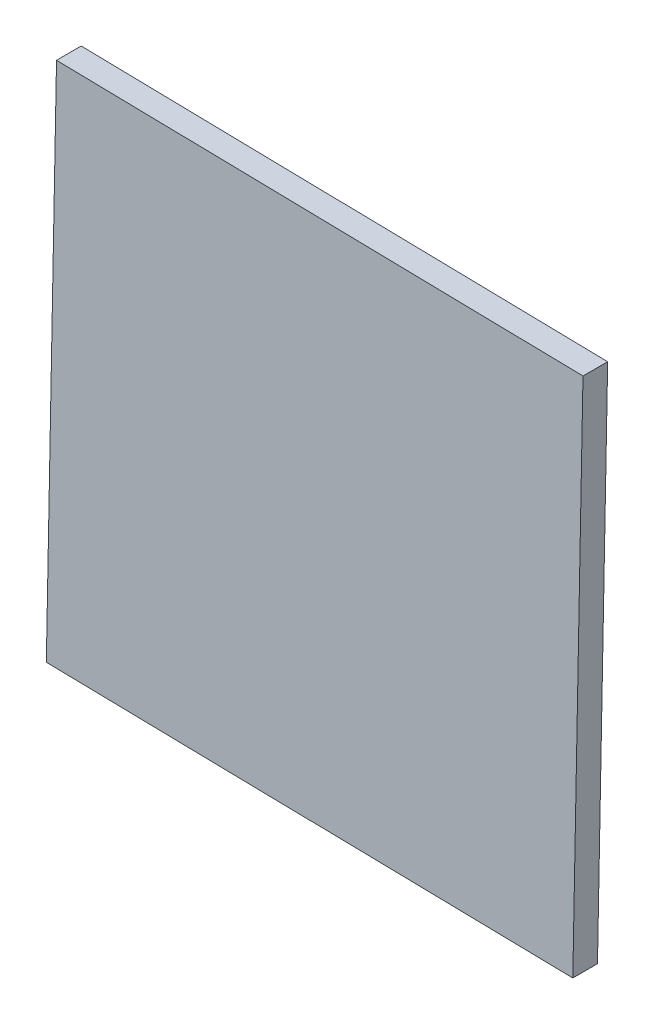
ISO-10303-21;
HEADER;
FILE_DESCRIPTION(('STEP AP214'),'2;1');
FILE_NAME('part.step','',(''),(''),'','','');
FILE_SCHEMA(('AUTOMOTIVE_DESIGN { 1 0 10303 214 1 1 1 1 }'));
ENDSEC;
DATA;
#1=APPLICATION_CONTEXT('core data for automotive mechanical design processes');
#2=APPLICATION_PROTOCOL_DEFINITION('international standard','automotive_design',2000,#1);
#3=PRODUCT_CONTEXT('',#1,'mechanical');
#4=PRODUCT('Part','Part','',(#3));
#5=PRODUCT_RELATED_PRODUCT_CATEGORY('part','',(#4));
#6=PRODUCT_DEFINITION_FORMATION('','',#4);
#7=PRODUCT_DEFINITION_CONTEXT('part definition',#1,'design');
#8=PRODUCT_DEFINITION('design','',#6,#7);
#9=PRODUCT_DEFINITION_SHAPE('','',#8);
#10=(LENGTH_UNIT() NAMED_UNIT(*) SI_UNIT(.MILLI.,.METRE.));
#11=(NAMED_UNIT(*) PLANE_ANGLE_UNIT() SI_UNIT($,.RADIAN.));
#12=(NAMED_UNIT(*) SI_UNIT($,.STERADIAN.) SOLID_ANGLE_UNIT());
#13=UNCERTAINTY_MEASURE_WITH_UNIT(LENGTH_MEASURE(1.E-05),#10,'distance_accuracy_value','');
#14=(GEOMETRIC_REPRESENTATION_CONTEXT(3) GLOBAL_UNCERTAINTY_ASSIGNED_CONTEXT((#13)) GLOBAL_UNIT_ASSIGNED_CONTEXT((#10,
#11,#12)) REPRESENTATION_CONTEXT('',''));
#15=CARTESIAN_POINT('',(0.,0.,0.));
#16=DIRECTION('',(0.,0.,1.));
#17=DIRECTION('',(1.,0.,0.));
#18=AXIS2_PLACEMENT_3D('',#15,#16,#17);
#19=CARTESIAN_POINT('',(-1.66355339164993,3.30225427634785,43.6520965279299));
#20=DIRECTION('',(0.,0.,-1.));
#21=DIRECTION('',(-0.999812677663925,0.0193548335692301,0.));
#22=AXIS2_PLACEMENT_3D('',#19,#20,#21);
#23=PLANE('',#22);
#24=DIRECTION('',(-0.999812677663925,0.0193548335692301,0.));
#25=VECTOR('',#24,1.);
#26=CARTESIAN_POINT('',(6.30560796515175,-4.98153925495523,43.6520965279302));
#27=LINE('',#26,#25);
#28=CARTESIAN_POINT('',(6.30560796515175,-4.98153925495523,43.6520965279302));
#29=VERTEX_POINT('',#28);
#30=CARTESIAN_POINT('',(-9.94734692295302,-4.66690708045383,43.6520965279297));
#31=VERTEX_POINT('',#30);
#32=EDGE_CURVE('E59',#29,#31,#27,.T.);
#33=ORIENTED_EDGE('',*,*,#32,.T.);
#34=DIRECTION('',(0.0193548335692301,0.999812677663925,0.));
#35=VECTOR('',#34,1.);
#36=CARTESIAN_POINT('',(-9.94734692295302,-4.66690708045383,43.6520965279297));
#37=LINE('',#36,#35);
#38=CARTESIAN_POINT('',(-9.63271474845161,11.5860478076509,43.6520965279295));
#39=VERTEX_POINT('',#38);
#40=EDGE_CURVE('E20',#31,#39,#37,.T.);
#41=ORIENTED_EDGE('',*,*,#40,.T.);
#42=DIRECTION('',(0.999812677663925,-0.0193548335692301,0.));
#43=VECTOR('',#42,1.);
#44=CARTESIAN_POINT('',(6.62024013965315,11.2714156331495,43.65209652793));
#45=LINE('',#44,#43);
#46=CARTESIAN_POINT('',(6.62024013965315,11.2714156331495,43.65209652793));
#47=VERTEX_POINT('',#46);
#48=EDGE_CURVE('E56',#39,#47,#45,.T.);
#49=ORIENTED_EDGE('',*,*,#48,.T.);
#50=DIRECTION('',(-0.0193548335692301,-0.999812677663925,0.));
#51=VECTOR('',#50,1.);
#52=CARTESIAN_POINT('',(6.30560796515175,-4.98153925495523,43.6520965279302));
#53=LINE('',#52,#51);
#54=EDGE_CURVE('E84',#47,#29,#53,.T.);
#55=ORIENTED_EDGE('',*,*,#54,.T.);
#56=EDGE_LOOP('',(#33,#41,#49,#55));
#57=FACE_BOUND('',#56,.T.);
#58=ADVANCED_FACE('F17',(#57),#23,.T.);
#59=CARTESIAN_POINT('',(-9.94734692295304,-4.66690708045382,44.4140965279297));
#60=DIRECTION('',(0.999812677663925,-0.0193548335692301,0.));
#61=DIRECTION('',(0.0193548335692301,0.999812677663925,0.));
#62=AXIS2_PLACEMENT_3D('',#59,#60,#61);
#63=PLANE('',#62);
#64=DIRECTION('',(0.,0.,1.));
#65=VECTOR('',#64,1.);
#66=CARTESIAN_POINT('',(-9.63271474845164,11.5860478076509,44.4140965279295));
#67=LINE('',#66,#65);
#68=CARTESIAN_POINT('',(-9.63271474845164,11.5860478076509,44.4140965279295));
#69=VERTEX_POINT('',#68);
#70=EDGE_CURVE('E65',#69,#39,#67,.F.);
#71=ORIENTED_EDGE('',*,*,#70,.T.);
#72=ORIENTED_EDGE('',*,*,#40,.F.);
#73=DIRECTION('',(0.,0.,1.));
#74=VECTOR('',#73,1.);
#75=CARTESIAN_POINT('',(-9.94734692295304,-4.66690708045382,44.4140965279297));
#76=LINE('',#75,#74);
#77=CARTESIAN_POINT('',(-9.94734692295304,-4.66690708045382,44.4140965279297));
#78=VERTEX_POINT('',#77);
#79=EDGE_CURVE('E90',#31,#78,#76,.T.);
#80=ORIENTED_EDGE('',*,*,#79,.T.);
#81=DIRECTION('',(0.0193548335692301,0.999812677663925,0.));
#82=VECTOR('',#81,1.);
#83=CARTESIAN_POINT('',(-9.79003083570234,3.45957036359857,44.4140965279295));
#84=LINE('',#83,#82);
#85=EDGE_CURVE('E76',#78,#69,#84,.T.);
#86=ORIENTED_EDGE('',*,*,#85,.T.);
#87=EDGE_LOOP('',(#71,#72,#80,#86));
#88=FACE_BOUND('',#87,.T.);
#89=ADVANCED_FACE('F75',(#88),#63,.F.);
#90=CARTESIAN_POINT('',(6.62024013965313,11.2714156331495,44.41409652793));
#91=DIRECTION('',(-0.0193548335692301,-0.999812677663925,0.));
#92=DIRECTION('',(0.999812677663925,-0.0193548335692301,0.));
#93=AXIS2_PLACEMENT_3D('',#90,#91,#92);
#94=PLANE('',#93);
#95=DIRECTION('',(0.,0.,1.));
#96=VECTOR('',#95,1.);
#97=CARTESIAN_POINT('',(6.62024013965313,11.2714156331495,44.41409652793));
#98=LINE('',#97,#96);
#99=CARTESIAN_POINT('',(6.62024013965313,11.2714156331495,44.41409652793));
#100=VERTEX_POINT('',#99);
#101=EDGE_CURVE('E71',#100,#47,#98,.F.);
#102=ORIENTED_EDGE('',*,*,#101,.T.);
#103=ORIENTED_EDGE('',*,*,#48,.F.);
#104=ORIENTED_EDGE('',*,*,#70,.F.);
#105=DIRECTION('',(-0.999812677663925,0.0193548335692301,0.));
#106=VECTOR('',#105,1.);
#107=CARTESIAN_POINT('',(-1.50623730439925,11.4287317204002,44.4140965279297));
#108=LINE('',#107,#106);
#109=EDGE_CURVE('E94',#69,#100,#108,.F.);
#110=ORIENTED_EDGE('',*,*,#109,.T.);
#111=EDGE_LOOP('',(#102,#103,#104,#110));
#112=FACE_BOUND('',#111,.T.);
#113=ADVANCED_FACE('F68',(#112),#94,.F.);
#114=CARTESIAN_POINT('',(6.30560796515172,-4.98153925495522,44.4140965279302));
#115=DIRECTION('',(-0.999812677663925,0.0193548335692301,0.));
#116=DIRECTION('',(-0.0193548335692301,-0.999812677663925,0.));
#117=AXIS2_PLACEMENT_3D('',#114,#115,#116);
#118=PLANE('',#117);
#119=DIRECTION('',(0.,0.,1.));
#120=VECTOR('',#119,1.);
#121=CARTESIAN_POINT('',(6.30560796515172,-4.98153925495522,44.4140965279302));
#122=LINE('',#121,#120);
#123=CARTESIAN_POINT('',(6.30560796515172,-4.98153925495522,44.4140965279302));
#124=VERTEX_POINT('',#123);
#125=EDGE_CURVE('E35',#124,#29,#122,.F.);
#126=ORIENTED_EDGE('',*,*,#125,.T.);
#127=ORIENTED_EDGE('',*,*,#54,.F.);
#128=ORIENTED_EDGE('',*,*,#101,.F.);
#129=DIRECTION('',(0.0193548335692301,0.999812677663925,0.));
#130=VECTOR('',#129,1.);
#131=CARTESIAN_POINT('',(6.46292405240242,3.14493818909716,44.4140965279301));
#132=LINE('',#131,#130);
#133=EDGE_CURVE('E27',#100,#124,#132,.F.);
#134=ORIENTED_EDGE('',*,*,#133,.T.);
#135=EDGE_LOOP('',(#126,#127,#128,#134));
#136=FACE_BOUND('',#135,.T.);
#137=ADVANCED_FACE('F101',(#136),#118,.F.);
#138=CARTESIAN_POINT('',(6.30560796515172,-4.98153925495522,44.4140965279302));
#139=DIRECTION('',(0.0193548335692301,0.999812677663925,0.));
#140=DIRECTION('',(-0.999812677663925,0.0193548335692301,0.));
#141=AXIS2_PLACEMENT_3D('',#138,#139,#140);
#142=PLANE('',#141);
#143=ORIENTED_EDGE('',*,*,#79,.F.);
#144=ORIENTED_EDGE('',*,*,#32,.F.);
#145=ORIENTED_EDGE('',*,*,#125,.F.);
#146=DIRECTION('',(-0.999812677663925,0.0193548335692301,0.));
#147=VECTOR('',#146,1.);
#148=CARTESIAN_POINT('',(-1.82086947890066,-4.82422316770452,44.4140965279299));
#149=LINE('',#148,#147);
#150=EDGE_CURVE('E11',#124,#78,#149,.T.);
#151=ORIENTED_EDGE('',*,*,#150,.T.);
#152=EDGE_LOOP('',(#143,#144,#145,#151));
#153=FACE_BOUND('',#152,.T.);
#154=ADVANCED_FACE('F104',(#153),#142,.F.);
#155=CARTESIAN_POINT('',(-1.66355339164995,3.30225427634787,44.4140965279298));
#156=DIRECTION('',(0.,0.,-1.));
#157=DIRECTION('',(-0.999812677663925,0.0193548335692301,0.));
#158=AXIS2_PLACEMENT_3D('',#155,#156,#157);
#159=PLANE('',#158);
#160=ORIENTED_EDGE('',*,*,#133,.F.);
#161=ORIENTED_EDGE('',*,*,#109,.F.);
#162=ORIENTED_EDGE('',*,*,#85,.F.);
#163=ORIENTED_EDGE('',*,*,#150,.F.);
#164=EDGE_LOOP('',(#160,#161,#162,#163));
#165=FACE_BOUND('',#164,.T.);
#166=ADVANCED_FACE('F103',(#165),#159,.F.);
#167=CLOSED_SHELL('',(#58,#89,#113,#137,#154,#166));
#168=MANIFOLD_SOLID_BREP('B1',#167);
#169=ADVANCED_BREP_SHAPE_REPRESENTATION('',(#18,#168),#14);
#170=SHAPE_DEFINITION_REPRESENTATION(#9,#169);
ENDSEC;
END-ISO-10303-21;
